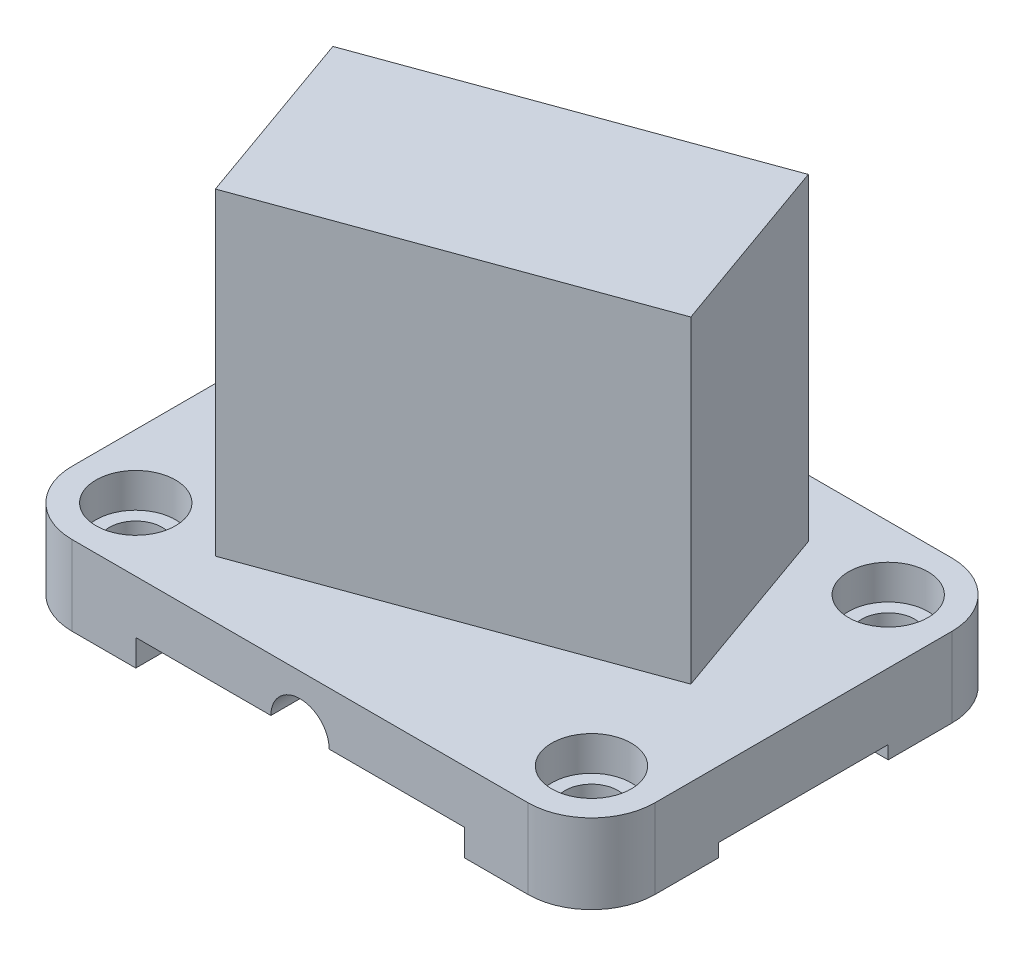
ISO-10303-21;
HEADER;
FILE_DESCRIPTION(('STEP AP214'),'2;1');
FILE_NAME('part.step','',(''),(''),'','','');
FILE_SCHEMA(('AUTOMOTIVE_DESIGN { 1 0 10303 214 1 1 1 1 }'));
ENDSEC;
DATA;
#1=APPLICATION_CONTEXT('core data for automotive mechanical design processes');
#2=APPLICATION_PROTOCOL_DEFINITION('international standard','automotive_design',2000,#1);
#3=PRODUCT_CONTEXT('',#1,'mechanical');
#4=PRODUCT('Part','Part','',(#3));
#5=PRODUCT_RELATED_PRODUCT_CATEGORY('part','',(#4));
#6=PRODUCT_DEFINITION_FORMATION('','',#4);
#7=PRODUCT_DEFINITION_CONTEXT('part definition',#1,'design');
#8=PRODUCT_DEFINITION('design','',#6,#7);
#9=PRODUCT_DEFINITION_SHAPE('','',#8);
#10=(LENGTH_UNIT() NAMED_UNIT(*) SI_UNIT(.MILLI.,.METRE.));
#11=(NAMED_UNIT(*) PLANE_ANGLE_UNIT() SI_UNIT($,.RADIAN.));
#12=(NAMED_UNIT(*) SI_UNIT($,.STERADIAN.) SOLID_ANGLE_UNIT());
#13=UNCERTAINTY_MEASURE_WITH_UNIT(LENGTH_MEASURE(1.E-05),#10,'distance_accuracy_value','');
#14=(GEOMETRIC_REPRESENTATION_CONTEXT(3) GLOBAL_UNCERTAINTY_ASSIGNED_CONTEXT((#13)) GLOBAL_UNIT_ASSIGNED_CONTEXT((#10,
#11,#12)) REPRESENTATION_CONTEXT('',''));
#15=CARTESIAN_POINT('',(0.,0.,0.));
#16=DIRECTION('',(0.,0.,1.));
#17=DIRECTION('',(1.,0.,0.));
#18=AXIS2_PLACEMENT_3D('',#15,#16,#17);
#19=CARTESIAN_POINT('',(-54.61,19.05,-35.56));
#20=DIRECTION('',(0.,1.,0.));
#21=DIRECTION('',(0.,0.,1.));
#22=AXIS2_PLACEMENT_3D('',#19,#20,#21);
#23=PLANE('',#22);
#24=CARTESIAN_POINT('',(-54.61,19.05,-35.56));
#25=DIRECTION('',(0.,1.,0.));
#26=DIRECTION('',(0.,0.,1.));
#27=AXIS2_PLACEMENT_3D('',#24,#25,#26);
#28=CIRCLE('',#27,9.525);
#29=CARTESIAN_POINT('',(-54.61,19.05,-26.035));
#30=VERTEX_POINT('',#29);
#31=EDGE_CURVE('E314',#30,#30,#28,.T.);
#32=ORIENTED_EDGE('',*,*,#31,.F.);
#33=EDGE_LOOP('',(#32));
#34=FACE_BOUND('',#33,.T.);
#35=CARTESIAN_POINT('',(54.61,19.05,-35.56));
#36=DIRECTION('',(0.,1.,0.));
#37=DIRECTION('',(0.,0.,1.));
#38=AXIS2_PLACEMENT_3D('',#35,#36,#37);
#39=CIRCLE('',#38,9.525);
#40=CARTESIAN_POINT('',(54.61,19.05,-26.035));
#41=VERTEX_POINT('',#40);
#42=EDGE_CURVE('E338',#41,#41,#39,.T.);
#43=ORIENTED_EDGE('',*,*,#42,.F.);
#44=EDGE_LOOP('',(#43));
#45=FACE_BOUND('',#44,.T.);
#46=CARTESIAN_POINT('',(-54.61,19.05,35.56));
#47=DIRECTION('',(0.,1.,0.));
#48=DIRECTION('',(0.,0.,1.));
#49=AXIS2_PLACEMENT_3D('',#46,#47,#48);
#50=CIRCLE('',#49,9.525);
#51=CARTESIAN_POINT('',(-54.61,19.05,45.085));
#52=VERTEX_POINT('',#51);
#53=EDGE_CURVE('E350',#52,#52,#50,.T.);
#54=ORIENTED_EDGE('',*,*,#53,.F.);
#55=EDGE_LOOP('',(#54));
#56=FACE_BOUND('',#55,.T.);
#57=CARTESIAN_POINT('',(54.61,19.05,35.56));
#58=DIRECTION('',(0.,1.,0.));
#59=DIRECTION('',(0.,0.,1.));
#60=AXIS2_PLACEMENT_3D('',#57,#58,#59);
#61=CIRCLE('',#60,9.525);
#62=CARTESIAN_POINT('',(54.61,19.05,45.085));
#63=VERTEX_POINT('',#62);
#64=EDGE_CURVE('E362',#63,#63,#61,.T.);
#65=ORIENTED_EDGE('',*,*,#64,.F.);
#66=EDGE_LOOP('',(#65));
#67=FACE_BOUND('',#66,.T.);
#68=CARTESIAN_POINT('',(-54.61,19.05,-35.56));
#69=DIRECTION('',(0.,1.,0.));
#70=DIRECTION('',(0.,0.,1.));
#71=AXIS2_PLACEMENT_3D('',#68,#69,#70);
#72=CIRCLE('',#71,15.24);
#73=CARTESIAN_POINT('',(-54.6099999999999,19.05,-50.8));
#74=VERTEX_POINT('',#73);
#75=CARTESIAN_POINT('',(-69.85,19.05,-35.5599999999999));
#76=VERTEX_POINT('',#75);
#77=EDGE_CURVE('E375',#74,#76,#72,.T.);
#78=ORIENTED_EDGE('',*,*,#77,.T.);
#79=DIRECTION('',(0.,0.,1.));
#80=VECTOR('',#79,1.);
#81=CARTESIAN_POINT('',(-69.85,19.05,-35.5599999999999));
#82=LINE('',#81,#80);
#83=CARTESIAN_POINT('',(-69.85,19.05,35.5599999999999));
#84=VERTEX_POINT('',#83);
#85=EDGE_CURVE('E378',#76,#84,#82,.T.);
#86=ORIENTED_EDGE('',*,*,#85,.T.);
#87=CARTESIAN_POINT('',(-54.61,19.05,35.56));
#88=DIRECTION('',(0.,1.,0.));
#89=DIRECTION('',(0.,0.,1.));
#90=AXIS2_PLACEMENT_3D('',#87,#88,#89);
#91=CIRCLE('',#90,15.24);
#92=CARTESIAN_POINT('',(-54.6099999999999,19.05,50.8));
#93=VERTEX_POINT('',#92);
#94=EDGE_CURVE('E381',#84,#93,#91,.T.);
#95=ORIENTED_EDGE('',*,*,#94,.T.);
#96=DIRECTION('',(1.,0.,0.));
#97=VECTOR('',#96,1.);
#98=CARTESIAN_POINT('',(-54.6099999999999,19.05,50.8));
#99=LINE('',#98,#97);
#100=CARTESIAN_POINT('',(54.6099999999999,19.05,50.8));
#101=VERTEX_POINT('',#100);
#102=EDGE_CURVE('E383',#93,#101,#99,.T.);
#103=ORIENTED_EDGE('',*,*,#102,.T.);
#104=CARTESIAN_POINT('',(54.61,19.05,35.56));
#105=DIRECTION('',(0.,1.,0.));
#106=DIRECTION('',(0.,0.,1.));
#107=AXIS2_PLACEMENT_3D('',#104,#105,#106);
#108=CIRCLE('',#107,15.24);
#109=CARTESIAN_POINT('',(69.85,19.05,35.5599999999999));
#110=VERTEX_POINT('',#109);
#111=EDGE_CURVE('E385',#101,#110,#108,.T.);
#112=ORIENTED_EDGE('',*,*,#111,.T.);
#113=DIRECTION('',(0.,0.,-1.));
#114=VECTOR('',#113,1.);
#115=CARTESIAN_POINT('',(69.85,19.05,-35.5599999999999));
#116=LINE('',#115,#114);
#117=CARTESIAN_POINT('',(69.85,19.05,-35.5599999999999));
#118=VERTEX_POINT('',#117);
#119=EDGE_CURVE('E387',#110,#118,#116,.T.);
#120=ORIENTED_EDGE('',*,*,#119,.T.);
#121=CARTESIAN_POINT('',(54.61,19.05,-35.56));
#122=DIRECTION('',(0.,1.,0.));
#123=DIRECTION('',(0.,0.,-1.));
#124=AXIS2_PLACEMENT_3D('',#121,#122,#123);
#125=CIRCLE('',#124,15.24);
#126=CARTESIAN_POINT('',(54.6099999999999,19.05,-50.8));
#127=VERTEX_POINT('',#126);
#128=EDGE_CURVE('E389',#118,#127,#125,.T.);
#129=ORIENTED_EDGE('',*,*,#128,.T.);
#130=DIRECTION('',(-1.,0.,0.));
#131=VECTOR('',#130,1.);
#132=CARTESIAN_POINT('',(-54.6099999999999,19.05,-50.8));
#133=LINE('',#132,#131);
#134=EDGE_CURVE('E391',#127,#74,#133,.T.);
#135=ORIENTED_EDGE('',*,*,#134,.T.);
#136=EDGE_LOOP('',(#78,#86,#95,#103,#112,#120,#129,#135));
#137=FACE_BOUND('',#136,.T.);
#138=DIRECTION('',(0.334836069725655,0.,0.942276395974491));
#139=VECTOR('',#138,1.);
#140=CARTESIAN_POINT('',(-49.53,19.05,-6.60400000000001));
#141=LINE('',#140,#139);
#142=CARTESIAN_POINT('',(-49.53,19.05,-6.60400000000001));
#143=VERTEX_POINT('',#142);
#144=CARTESIAN_POINT('',(-34.0086739878672,19.05,37.0752223353975));
#145=VERTEX_POINT('',#144);
#146=EDGE_CURVE('E850',#143,#145,#141,.T.);
#147=ORIENTED_EDGE('',*,*,#146,.F.);
#148=DIRECTION('',(-0.939692620785908,0.,0.34202014332567));
#149=VECTOR('',#148,1.);
#150=CARTESIAN_POINT('',(34.0086739878672,19.05,-37.009590741652));
#151=LINE('',#150,#149);
#152=CARTESIAN_POINT('',(34.0086739878672,19.05,-37.009590741652));
#153=VERTEX_POINT('',#152);
#154=EDGE_CURVE('E235',#153,#143,#151,.T.);
#155=ORIENTED_EDGE('',*,*,#154,.F.);
#156=DIRECTION('',(-0.334836069725655,0.,-0.942276395974491));
#157=VECTOR('',#156,1.);
#158=CARTESIAN_POINT('',(49.53,19.05,6.66963159374552));
#159=LINE('',#158,#157);
#160=CARTESIAN_POINT('',(49.53,19.05,6.66963159374552));
#161=VERTEX_POINT('',#160);
#162=EDGE_CURVE('E231',#161,#153,#159,.T.);
#163=ORIENTED_EDGE('',*,*,#162,.F.);
#164=DIRECTION('',(0.939692620785908,0.,-0.342020143325669));
#165=VECTOR('',#164,1.);
#166=CARTESIAN_POINT('',(-34.0086739878672,19.05,37.0752223353975));
#167=LINE('',#166,#165);
#168=EDGE_CURVE('E847',#145,#161,#167,.T.);
#169=ORIENTED_EDGE('',*,*,#168,.F.);
#170=EDGE_LOOP('',(#147,#155,#163,#169));
#171=FACE_BOUND('',#170,.T.);
#172=ADVANCED_FACE('F39',(#34,#45,#56,#67,#137,#171),#23,.T.);
#173=CARTESIAN_POINT('',(-54.61,0.,-35.56));
#174=DIRECTION('',(0.,1.,0.));
#175=DIRECTION('',(0.,0.,1.));
#176=AXIS2_PLACEMENT_3D('',#173,#174,#175);
#177=PLANE('',#176);
#178=CARTESIAN_POINT('',(-54.61,0.,-35.56));
#179=DIRECTION('',(0.,1.,0.));
#180=DIRECTION('',(0.,0.,1.));
#181=AXIS2_PLACEMENT_3D('',#178,#179,#180);
#182=CIRCLE('',#181,6.35);
#183=CARTESIAN_POINT('',(-54.61,0.,-29.21));
#184=VERTEX_POINT('',#183);
#185=EDGE_CURVE('E335',#184,#184,#182,.T.);
#186=ORIENTED_EDGE('',*,*,#185,.T.);
#187=EDGE_LOOP('',(#186));
#188=FACE_BOUND('',#187,.T.);
#189=DIRECTION('',(0.,0.,1.));
#190=VECTOR('',#189,1.);
#191=CARTESIAN_POINT('',(-39.37,0.,-50.8));
#192=LINE('',#191,#190);
#193=CARTESIAN_POINT('',(-39.37,0.,-50.8));
#194=VERTEX_POINT('',#193);
#195=CARTESIAN_POINT('',(-39.37,0.,-20.32));
#196=VERTEX_POINT('',#195);
#197=EDGE_CURVE('E311',#194,#196,#192,.T.);
#198=ORIENTED_EDGE('',*,*,#197,.T.);
#199=DIRECTION('',(-1.,0.,0.));
#200=VECTOR('',#199,1.);
#201=CARTESIAN_POINT('',(69.85,0.,-20.32));
#202=LINE('',#201,#200);
#203=CARTESIAN_POINT('',(-69.85,0.,-20.32));
#204=VERTEX_POINT('',#203);
#205=EDGE_CURVE('E262',#196,#204,#202,.T.);
#206=ORIENTED_EDGE('',*,*,#205,.T.);
#207=DIRECTION('',(0.,0.,1.));
#208=VECTOR('',#207,1.);
#209=CARTESIAN_POINT('',(-69.85,0.,-35.5599999999999));
#210=LINE('',#209,#208);
#211=CARTESIAN_POINT('',(-69.85,0.,-35.5599999999999));
#212=VERTEX_POINT('',#211);
#213=EDGE_CURVE('E397',#212,#204,#210,.T.);
#214=ORIENTED_EDGE('',*,*,#213,.F.);
#215=CARTESIAN_POINT('',(-54.61,0.,-35.56));
#216=DIRECTION('',(0.,1.,0.));
#217=DIRECTION('',(0.,0.,1.));
#218=AXIS2_PLACEMENT_3D('',#215,#216,#217);
#219=CIRCLE('',#218,15.24);
#220=CARTESIAN_POINT('',(-54.6099999999999,0.,-50.8));
#221=VERTEX_POINT('',#220);
#222=EDGE_CURVE('E374',#221,#212,#219,.T.);
#223=ORIENTED_EDGE('',*,*,#222,.F.);
#224=DIRECTION('',(-1.,0.,0.));
#225=VECTOR('',#224,1.);
#226=CARTESIAN_POINT('',(-54.6099999999999,0.,-50.8));
#227=LINE('',#226,#225);
#228=EDGE_CURVE('E414',#194,#221,#227,.T.);
#229=ORIENTED_EDGE('',*,*,#228,.F.);
#230=EDGE_LOOP('',(#198,#206,#214,#223,#229));
#231=FACE_BOUND('',#230,.T.);
#232=ADVANCED_FACE('F518',(#188,#231),#177,.F.);
#233=CARTESIAN_POINT('',(54.61,0.,-35.56));
#234=DIRECTION('',(0.,1.,0.));
#235=DIRECTION('',(0.,0.,1.));
#236=AXIS2_PLACEMENT_3D('',#233,#234,#235);
#237=CIRCLE('',#236,6.35);
#238=CARTESIAN_POINT('',(54.61,0.,-29.21));
#239=VERTEX_POINT('',#238);
#240=EDGE_CURVE('E347',#239,#239,#237,.T.);
#241=ORIENTED_EDGE('',*,*,#240,.T.);
#242=EDGE_LOOP('',(#241));
#243=FACE_BOUND('',#242,.T.);
#244=DIRECTION('',(0.,0.,-1.));
#245=VECTOR('',#244,1.);
#246=CARTESIAN_POINT('',(69.85,0.,-35.5599999999999));
#247=LINE('',#246,#245);
#248=CARTESIAN_POINT('',(69.85,0.,-20.32));
#249=VERTEX_POINT('',#248);
#250=CARTESIAN_POINT('',(69.85,0.,-35.5599999999999));
#251=VERTEX_POINT('',#250);
#252=EDGE_CURVE('E408',#249,#251,#247,.T.);
#253=ORIENTED_EDGE('',*,*,#252,.F.);
#254=CARTESIAN_POINT('',(39.37,0.,-20.32));
#255=VERTEX_POINT('',#254);
#256=EDGE_CURVE('E258',#249,#255,#202,.T.);
#257=ORIENTED_EDGE('',*,*,#256,.T.);
#258=DIRECTION('',(0.,0.,1.));
#259=VECTOR('',#258,1.);
#260=CARTESIAN_POINT('',(39.37,0.,-50.8));
#261=LINE('',#260,#259);
#262=CARTESIAN_POINT('',(39.37,0.,-50.8));
#263=VERTEX_POINT('',#262);
#264=EDGE_CURVE('E324',#263,#255,#261,.T.);
#265=ORIENTED_EDGE('',*,*,#264,.F.);
#266=CARTESIAN_POINT('',(54.6099999999999,0.,-50.8));
#267=VERTEX_POINT('',#266);
#268=EDGE_CURVE('E379',#267,#263,#227,.T.);
#269=ORIENTED_EDGE('',*,*,#268,.F.);
#270=CARTESIAN_POINT('',(54.61,0.,-35.56));
#271=DIRECTION('',(0.,1.,0.));
#272=DIRECTION('',(0.,0.,-1.));
#273=AXIS2_PLACEMENT_3D('',#270,#271,#272);
#274=CIRCLE('',#273,15.24);
#275=EDGE_CURVE('E412',#251,#267,#274,.T.);
#276=ORIENTED_EDGE('',*,*,#275,.F.);
#277=EDGE_LOOP('',(#253,#257,#265,#269,#276));
#278=FACE_BOUND('',#277,.T.);
#279=ADVANCED_FACE('F478',(#243,#278),#177,.F.);
#280=CARTESIAN_POINT('',(-54.61,0.,35.56));
#281=DIRECTION('',(0.,1.,0.));
#282=DIRECTION('',(0.,0.,1.));
#283=AXIS2_PLACEMENT_3D('',#280,#281,#282);
#284=CIRCLE('',#283,6.35);
#285=CARTESIAN_POINT('',(-54.61,0.,41.91));
#286=VERTEX_POINT('',#285);
#287=EDGE_CURVE('E359',#286,#286,#284,.T.);
#288=ORIENTED_EDGE('',*,*,#287,.T.);
#289=EDGE_LOOP('',(#288));
#290=FACE_BOUND('',#289,.T.);
#291=CARTESIAN_POINT('',(-69.85,0.,20.32));
#292=VERTEX_POINT('',#291);
#293=CARTESIAN_POINT('',(-69.85,0.,35.5599999999999));
#294=VERTEX_POINT('',#293);
#295=EDGE_CURVE('E396',#292,#294,#210,.T.);
#296=ORIENTED_EDGE('',*,*,#295,.F.);
#297=DIRECTION('',(-1.,0.,0.));
#298=VECTOR('',#297,1.);
#299=CARTESIAN_POINT('',(69.85,0.,20.32));
#300=LINE('',#299,#298);
#301=CARTESIAN_POINT('',(-39.37,0.,20.32));
#302=VERTEX_POINT('',#301);
#303=EDGE_CURVE('E253',#302,#292,#300,.T.);
#304=ORIENTED_EDGE('',*,*,#303,.F.);
#305=CARTESIAN_POINT('',(-39.37,0.,50.8));
#306=VERTEX_POINT('',#305);
#307=EDGE_CURVE('E315',#302,#306,#192,.T.);
#308=ORIENTED_EDGE('',*,*,#307,.T.);
#309=DIRECTION('',(1.,0.,0.));
#310=VECTOR('',#309,1.);
#311=CARTESIAN_POINT('',(-54.6099999999999,0.,50.8));
#312=LINE('',#311,#310);
#313=CARTESIAN_POINT('',(-54.6099999999999,0.,50.8));
#314=VERTEX_POINT('',#313);
#315=EDGE_CURVE('E403',#314,#306,#312,.T.);
#316=ORIENTED_EDGE('',*,*,#315,.F.);
#317=CARTESIAN_POINT('',(-54.61,0.,35.56));
#318=DIRECTION('',(0.,1.,0.));
#319=DIRECTION('',(0.,0.,1.));
#320=AXIS2_PLACEMENT_3D('',#317,#318,#319);
#321=CIRCLE('',#320,15.24);
#322=EDGE_CURVE('E400',#294,#314,#321,.T.);
#323=ORIENTED_EDGE('',*,*,#322,.F.);
#324=EDGE_LOOP('',(#296,#304,#308,#316,#323));
#325=FACE_BOUND('',#324,.T.);
#326=ADVANCED_FACE('F504',(#290,#325),#177,.F.);
#327=CARTESIAN_POINT('',(-54.61,19.05,-35.56));
#328=DIRECTION('',(0.,-1.,0.));
#329=DIRECTION('',(0.,0.,-1.));
#330=AXIS2_PLACEMENT_3D('',#327,#328,#329);
#331=CYLINDRICAL_SURFACE('',#330,15.24);
#332=ORIENTED_EDGE('',*,*,#222,.T.);
#333=DIRECTION('',(0.,-1.,0.));
#334=VECTOR('',#333,1.);
#335=CARTESIAN_POINT('',(-69.85,19.05,-35.5599999999999));
#336=LINE('',#335,#334);
#337=EDGE_CURVE('E437',#76,#212,#336,.T.);
#338=ORIENTED_EDGE('',*,*,#337,.F.);
#339=ORIENTED_EDGE('',*,*,#77,.F.);
#340=DIRECTION('',(0.,-1.,0.));
#341=VECTOR('',#340,1.);
#342=CARTESIAN_POINT('',(-54.6099999999999,19.05,-50.8));
#343=LINE('',#342,#341);
#344=EDGE_CURVE('E393',#74,#221,#343,.T.);
#345=ORIENTED_EDGE('',*,*,#344,.T.);
#346=EDGE_LOOP('',(#332,#338,#339,#345));
#347=FACE_BOUND('',#346,.T.);
#348=ADVANCED_FACE('F41',(#347),#331,.T.);
#349=CARTESIAN_POINT('',(-69.85,19.05,-35.5599999999999));
#350=DIRECTION('',(1.,0.,0.));
#351=DIRECTION('',(0.,0.,-1.));
#352=AXIS2_PLACEMENT_3D('',#349,#350,#351);
#353=PLANE('',#352);
#354=ORIENTED_EDGE('',*,*,#213,.T.);
#355=DIRECTION('',(0.,-1.,0.));
#356=VECTOR('',#355,1.);
#357=CARTESIAN_POINT('',(-69.85,0.,-20.32));
#358=LINE('',#357,#356);
#359=CARTESIAN_POINT('',(-69.85,3.17499999999999,-20.32));
#360=VERTEX_POINT('',#359);
#361=EDGE_CURVE('E248',#360,#204,#358,.T.);
#362=ORIENTED_EDGE('',*,*,#361,.F.);
#363=DIRECTION('',(0.,0.,-1.));
#364=VECTOR('',#363,1.);
#365=CARTESIAN_POINT('',(-69.85,3.17499999999999,-20.32));
#366=LINE('',#365,#364);
#367=CARTESIAN_POINT('',(-69.85,3.17499999999999,20.32));
#368=VERTEX_POINT('',#367);
#369=EDGE_CURVE('E239',#368,#360,#366,.T.);
#370=ORIENTED_EDGE('',*,*,#369,.F.);
#371=DIRECTION('',(0.,1.,0.));
#372=VECTOR('',#371,1.);
#373=CARTESIAN_POINT('',(-69.85,3.17499999999999,20.32));
#374=LINE('',#373,#372);
#375=EDGE_CURVE('E237',#292,#368,#374,.T.);
#376=ORIENTED_EDGE('',*,*,#375,.F.);
#377=ORIENTED_EDGE('',*,*,#295,.T.);
#378=DIRECTION('',(0.,-1.,0.));
#379=VECTOR('',#378,1.);
#380=CARTESIAN_POINT('',(-69.85,19.05,35.5599999999999));
#381=LINE('',#380,#379);
#382=EDGE_CURVE('E434',#84,#294,#381,.T.);
#383=ORIENTED_EDGE('',*,*,#382,.F.);
#384=ORIENTED_EDGE('',*,*,#85,.F.);
#385=ORIENTED_EDGE('',*,*,#337,.T.);
#386=EDGE_LOOP('',(#354,#362,#370,#376,#377,#383,#384,#385));
#387=FACE_BOUND('',#386,.T.);
#388=ADVANCED_FACE('F525',(#387),#353,.F.);
#389=CARTESIAN_POINT('',(-54.61,19.05,35.56));
#390=DIRECTION('',(0.,-1.,0.));
#391=DIRECTION('',(0.,0.,-1.));
#392=AXIS2_PLACEMENT_3D('',#389,#390,#391);
#393=CYLINDRICAL_SURFACE('',#392,15.24);
#394=ORIENTED_EDGE('',*,*,#322,.T.);
#395=DIRECTION('',(0.,-1.,0.));
#396=VECTOR('',#395,1.);
#397=CARTESIAN_POINT('',(-54.6099999999999,19.05,50.8));
#398=LINE('',#397,#396);
#399=EDGE_CURVE('E431',#93,#314,#398,.T.);
#400=ORIENTED_EDGE('',*,*,#399,.F.);
#401=ORIENTED_EDGE('',*,*,#94,.F.);
#402=ORIENTED_EDGE('',*,*,#382,.T.);
#403=EDGE_LOOP('',(#394,#400,#401,#402));
#404=FACE_BOUND('',#403,.T.);
#405=ADVANCED_FACE('F527',(#404),#393,.T.);
#406=CARTESIAN_POINT('',(-54.6099999999999,19.05,50.8));
#407=DIRECTION('',(0.,0.,-1.));
#408=DIRECTION('',(-1.,0.,0.));
#409=AXIS2_PLACEMENT_3D('',#406,#407,#408);
#410=PLANE('',#409);
#411=ORIENTED_EDGE('',*,*,#315,.T.);
#412=DIRECTION('',(0.,-1.,0.));
#413=VECTOR('',#412,1.);
#414=CARTESIAN_POINT('',(-39.37,0.,50.8));
#415=LINE('',#414,#413);
#416=CARTESIAN_POINT('',(-39.37,6.34999999999999,50.8));
#417=VERTEX_POINT('',#416);
#418=EDGE_CURVE('E285',#417,#306,#415,.T.);
#419=ORIENTED_EDGE('',*,*,#418,.F.);
#420=DIRECTION('',(-1.,0.,0.));
#421=VECTOR('',#420,1.);
#422=CARTESIAN_POINT('',(-39.37,6.34999999999999,50.8));
#423=LINE('',#422,#421);
#424=CARTESIAN_POINT('',(-6.985,6.34999999999999,50.8));
#425=VERTEX_POINT('',#424);
#426=EDGE_CURVE('E306',#425,#417,#423,.T.);
#427=ORIENTED_EDGE('',*,*,#426,.F.);
#428=CARTESIAN_POINT('',(0.,6.34999999999999,50.8));
#429=DIRECTION('',(0.,0.,1.));
#430=DIRECTION('',(1.,0.,0.));
#431=AXIS2_PLACEMENT_3D('',#428,#429,#430);
#432=CIRCLE('',#431,6.985);
#433=CARTESIAN_POINT('',(6.985,6.34999999999999,50.8));
#434=VERTEX_POINT('',#433);
#435=EDGE_CURVE('E303',#434,#425,#432,.T.);
#436=ORIENTED_EDGE('',*,*,#435,.F.);
#437=DIRECTION('',(-1.,0.,0.));
#438=VECTOR('',#437,1.);
#439=CARTESIAN_POINT('',(6.985,6.34999999999999,50.8));
#440=LINE('',#439,#438);
#441=CARTESIAN_POINT('',(39.37,6.34999999999999,50.8));
#442=VERTEX_POINT('',#441);
#443=EDGE_CURVE('E300',#442,#434,#440,.T.);
#444=ORIENTED_EDGE('',*,*,#443,.F.);
#445=DIRECTION('',(0.,1.,0.));
#446=VECTOR('',#445,1.);
#447=CARTESIAN_POINT('',(39.37,6.34999999999999,50.8));
#448=LINE('',#447,#446);
#449=CARTESIAN_POINT('',(39.37,0.,50.8));
#450=VERTEX_POINT('',#449);
#451=EDGE_CURVE('E280',#450,#442,#448,.T.);
#452=ORIENTED_EDGE('',*,*,#451,.F.);
#453=CARTESIAN_POINT('',(54.6099999999999,0.,50.8));
#454=VERTEX_POINT('',#453);
#455=EDGE_CURVE('E402',#450,#454,#312,.T.);
#456=ORIENTED_EDGE('',*,*,#455,.T.);
#457=DIRECTION('',(0.,-1.,0.));
#458=VECTOR('',#457,1.);
#459=CARTESIAN_POINT('',(54.6099999999999,19.05,50.8));
#460=LINE('',#459,#458);
#461=EDGE_CURVE('E428',#101,#454,#460,.T.);
#462=ORIENTED_EDGE('',*,*,#461,.F.);
#463=ORIENTED_EDGE('',*,*,#102,.F.);
#464=ORIENTED_EDGE('',*,*,#399,.T.);
#465=EDGE_LOOP('',(#411,#419,#427,#436,#444,#452,#456,#462,#463,#464));
#466=FACE_BOUND('',#465,.T.);
#467=ADVANCED_FACE('F466',(#466),#410,.F.);
#468=CARTESIAN_POINT('',(54.61,19.05,35.56));
#469=DIRECTION('',(0.,-1.,0.));
#470=DIRECTION('',(0.,0.,-1.));
#471=AXIS2_PLACEMENT_3D('',#468,#469,#470);
#472=CYLINDRICAL_SURFACE('',#471,15.24);
#473=CARTESIAN_POINT('',(54.61,0.,35.56));
#474=DIRECTION('',(0.,1.,0.));
#475=DIRECTION('',(0.,0.,1.));
#476=AXIS2_PLACEMENT_3D('',#473,#474,#475);
#477=CIRCLE('',#476,15.24);
#478=CARTESIAN_POINT('',(69.85,0.,35.5599999999999));
#479=VERTEX_POINT('',#478);
#480=EDGE_CURVE('E406',#454,#479,#477,.T.);
#481=ORIENTED_EDGE('',*,*,#480,.T.);
#482=DIRECTION('',(0.,-1.,0.));
#483=VECTOR('',#482,1.);
#484=CARTESIAN_POINT('',(69.85,19.05,35.5599999999999));
#485=LINE('',#484,#483);
#486=EDGE_CURVE('E425',#110,#479,#485,.T.);
#487=ORIENTED_EDGE('',*,*,#486,.F.);
#488=ORIENTED_EDGE('',*,*,#111,.F.);
#489=ORIENTED_EDGE('',*,*,#461,.T.);
#490=EDGE_LOOP('',(#481,#487,#488,#489));
#491=FACE_BOUND('',#490,.T.);
#492=ADVANCED_FACE('F495',(#491),#472,.T.);
#493=CARTESIAN_POINT('',(69.85,19.05,-35.5599999999999));
#494=DIRECTION('',(-1.,0.,0.));
#495=DIRECTION('',(0.,0.,1.));
#496=AXIS2_PLACEMENT_3D('',#493,#494,#495);
#497=PLANE('',#496);
#498=DIRECTION('',(0.,0.,-1.));
#499=VECTOR('',#498,1.);
#500=CARTESIAN_POINT('',(69.85,3.17499999999999,-20.32));
#501=LINE('',#500,#499);
#502=CARTESIAN_POINT('',(69.85,3.17499999999999,20.32));
#503=VERTEX_POINT('',#502);
#504=CARTESIAN_POINT('',(69.85,3.17499999999999,-20.32));
#505=VERTEX_POINT('',#504);
#506=EDGE_CURVE('E247',#503,#505,#501,.T.);
#507=ORIENTED_EDGE('',*,*,#506,.T.);
#508=DIRECTION('',(0.,-1.,0.));
#509=VECTOR('',#508,1.);
#510=CARTESIAN_POINT('',(69.85,0.,-20.32));
#511=LINE('',#510,#509);
#512=EDGE_CURVE('E251',#505,#249,#511,.T.);
#513=ORIENTED_EDGE('',*,*,#512,.T.);
#514=ORIENTED_EDGE('',*,*,#252,.T.);
#515=DIRECTION('',(0.,-1.,0.));
#516=VECTOR('',#515,1.);
#517=CARTESIAN_POINT('',(69.85,19.05,-35.5599999999999));
#518=LINE('',#517,#516);
#519=EDGE_CURVE('E422',#118,#251,#518,.T.);
#520=ORIENTED_EDGE('',*,*,#519,.F.);
#521=ORIENTED_EDGE('',*,*,#119,.F.);
#522=ORIENTED_EDGE('',*,*,#486,.T.);
#523=CARTESIAN_POINT('',(69.85,0.,20.32));
#524=VERTEX_POINT('',#523);
#525=EDGE_CURVE('E409',#479,#524,#247,.T.);
#526=ORIENTED_EDGE('',*,*,#525,.T.);
#527=DIRECTION('',(0.,1.,0.));
#528=VECTOR('',#527,1.);
#529=CARTESIAN_POINT('',(69.85,3.17499999999999,20.32));
#530=LINE('',#529,#528);
#531=EDGE_CURVE('E244',#524,#503,#530,.T.);
#532=ORIENTED_EDGE('',*,*,#531,.T.);
#533=EDGE_LOOP('',(#507,#513,#514,#520,#521,#522,#526,#532));
#534=FACE_BOUND('',#533,.T.);
#535=ADVANCED_FACE('F454',(#534),#497,.F.);
#536=CARTESIAN_POINT('',(54.61,19.05,-35.56));
#537=DIRECTION('',(0.,-1.,0.));
#538=DIRECTION('',(0.,0.,-1.));
#539=AXIS2_PLACEMENT_3D('',#536,#537,#538);
#540=CYLINDRICAL_SURFACE('',#539,15.24);
#541=ORIENTED_EDGE('',*,*,#275,.T.);
#542=DIRECTION('',(0.,-1.,0.));
#543=VECTOR('',#542,1.);
#544=CARTESIAN_POINT('',(54.6099999999999,19.05,-50.8));
#545=LINE('',#544,#543);
#546=EDGE_CURVE('E419',#127,#267,#545,.T.);
#547=ORIENTED_EDGE('',*,*,#546,.F.);
#548=ORIENTED_EDGE('',*,*,#128,.F.);
#549=ORIENTED_EDGE('',*,*,#519,.T.);
#550=EDGE_LOOP('',(#541,#547,#548,#549));
#551=FACE_BOUND('',#550,.T.);
#552=ADVANCED_FACE('F486',(#551),#540,.T.);
#553=CARTESIAN_POINT('',(-54.6099999999999,19.05,-50.8));
#554=DIRECTION('',(0.,0.,1.));
#555=DIRECTION('',(1.,0.,0.));
#556=AXIS2_PLACEMENT_3D('',#553,#554,#555);
#557=PLANE('',#556);
#558=DIRECTION('',(-1.,0.,0.));
#559=VECTOR('',#558,1.);
#560=CARTESIAN_POINT('',(-39.37,6.34999999999999,-50.8));
#561=LINE('',#560,#559);
#562=CARTESIAN_POINT('',(-6.985,6.34999999999999,-50.8));
#563=VERTEX_POINT('',#562);
#564=CARTESIAN_POINT('',(-39.37,6.34999999999999,-50.8));
#565=VERTEX_POINT('',#564);
#566=EDGE_CURVE('E291',#563,#565,#561,.T.);
#567=ORIENTED_EDGE('',*,*,#566,.T.);
#568=DIRECTION('',(0.,-1.,0.));
#569=VECTOR('',#568,1.);
#570=CARTESIAN_POINT('',(-39.37,0.,-50.8));
#571=LINE('',#570,#569);
#572=EDGE_CURVE('E294',#565,#194,#571,.T.);
#573=ORIENTED_EDGE('',*,*,#572,.T.);
#574=ORIENTED_EDGE('',*,*,#228,.T.);
#575=ORIENTED_EDGE('',*,*,#344,.F.);
#576=ORIENTED_EDGE('',*,*,#134,.F.);
#577=ORIENTED_EDGE('',*,*,#546,.T.);
#578=ORIENTED_EDGE('',*,*,#268,.T.);
#579=DIRECTION('',(0.,1.,0.));
#580=VECTOR('',#579,1.);
#581=CARTESIAN_POINT('',(39.37,6.34999999999999,-50.8));
#582=LINE('',#581,#580);
#583=CARTESIAN_POINT('',(39.37,6.34999999999999,-50.8));
#584=VERTEX_POINT('',#583);
#585=EDGE_CURVE('E281',#263,#584,#582,.T.);
#586=ORIENTED_EDGE('',*,*,#585,.T.);
#587=DIRECTION('',(-1.,0.,0.));
#588=VECTOR('',#587,1.);
#589=CARTESIAN_POINT('',(6.985,6.34999999999999,-50.8));
#590=LINE('',#589,#588);
#591=CARTESIAN_POINT('',(6.985,6.34999999999999,-50.8));
#592=VERTEX_POINT('',#591);
#593=EDGE_CURVE('E284',#584,#592,#590,.T.);
#594=ORIENTED_EDGE('',*,*,#593,.T.);
#595=CARTESIAN_POINT('',(0.,6.34999999999999,-50.8));
#596=DIRECTION('',(0.,0.,1.));
#597=DIRECTION('',(1.,0.,0.));
#598=AXIS2_PLACEMENT_3D('',#595,#596,#597);
#599=CIRCLE('',#598,6.985);
#600=EDGE_CURVE('E288',#592,#563,#599,.T.);
#601=ORIENTED_EDGE('',*,*,#600,.T.);
#602=EDGE_LOOP('',(#567,#573,#574,#575,#576,#577,#578,#586,#594,#601));
#603=FACE_BOUND('',#602,.T.);
#604=ADVANCED_FACE('F480',(#603),#557,.F.);
#605=CARTESIAN_POINT('',(54.61,0.,35.56));
#606=DIRECTION('',(0.,1.,0.));
#607=DIRECTION('',(0.,0.,1.));
#608=AXIS2_PLACEMENT_3D('',#605,#606,#607);
#609=CIRCLE('',#608,6.35);
#610=CARTESIAN_POINT('',(54.61,0.,41.91));
#611=VERTEX_POINT('',#610);
#612=EDGE_CURVE('E371',#611,#611,#609,.T.);
#613=ORIENTED_EDGE('',*,*,#612,.T.);
#614=EDGE_LOOP('',(#613));
#615=FACE_BOUND('',#614,.T.);
#616=CARTESIAN_POINT('',(39.37,0.,20.32));
#617=VERTEX_POINT('',#616);
#618=EDGE_CURVE('E297',#617,#450,#261,.T.);
#619=ORIENTED_EDGE('',*,*,#618,.F.);
#620=EDGE_CURVE('E270',#524,#617,#300,.T.);
#621=ORIENTED_EDGE('',*,*,#620,.F.);
#622=ORIENTED_EDGE('',*,*,#525,.F.);
#623=ORIENTED_EDGE('',*,*,#480,.F.);
#624=ORIENTED_EDGE('',*,*,#455,.F.);
#625=EDGE_LOOP('',(#619,#621,#622,#623,#624));
#626=FACE_BOUND('',#625,.T.);
#627=ADVANCED_FACE('F460',(#615,#626),#177,.F.);
#628=CARTESIAN_POINT('',(54.61,19.05,35.56));
#629=DIRECTION('',(0.,1.,0.));
#630=DIRECTION('',(0.,0.,1.));
#631=AXIS2_PLACEMENT_3D('',#628,#629,#630);
#632=CYLINDRICAL_SURFACE('',#631,6.35);
#633=ORIENTED_EDGE('',*,*,#612,.F.);
#634=EDGE_LOOP('',(#633));
#635=FACE_BOUND('',#634,.T.);
#636=CARTESIAN_POINT('',(54.61,10.795,35.56));
#637=DIRECTION('',(0.,1.,0.));
#638=DIRECTION('',(0.,0.,1.));
#639=AXIS2_PLACEMENT_3D('',#636,#637,#638);
#640=CIRCLE('',#639,6.35);
#641=CARTESIAN_POINT('',(54.61,10.795,41.91));
#642=VERTEX_POINT('',#641);
#643=EDGE_CURVE('E368',#642,#642,#640,.T.);
#644=ORIENTED_EDGE('',*,*,#643,.T.);
#645=EDGE_LOOP('',(#644));
#646=FACE_BOUND('',#645,.T.);
#647=ADVANCED_FACE('F550',(#635,#646),#632,.F.);
#648=CARTESIAN_POINT('',(60.96,10.795,35.56));
#649=DIRECTION('',(0.,-1.,0.));
#650=DIRECTION('',(0.,0.,-1.));
#651=AXIS2_PLACEMENT_3D('',#648,#649,#650);
#652=PLANE('',#651);
#653=ORIENTED_EDGE('',*,*,#643,.F.);
#654=EDGE_LOOP('',(#653));
#655=FACE_BOUND('',#654,.T.);
#656=CARTESIAN_POINT('',(54.61,10.795,35.56));
#657=DIRECTION('',(0.,1.,0.));
#658=DIRECTION('',(0.,0.,1.));
#659=AXIS2_PLACEMENT_3D('',#656,#657,#658);
#660=CIRCLE('',#659,9.525);
#661=CARTESIAN_POINT('',(54.61,10.795,45.085));
#662=VERTEX_POINT('',#661);
#663=EDGE_CURVE('E365',#662,#662,#660,.T.);
#664=ORIENTED_EDGE('',*,*,#663,.T.);
#665=EDGE_LOOP('',(#664));
#666=FACE_BOUND('',#665,.T.);
#667=ADVANCED_FACE('F578',(#655,#666),#652,.F.);
#668=CARTESIAN_POINT('',(54.61,19.05,35.56));
#669=DIRECTION('',(0.,1.,0.));
#670=DIRECTION('',(0.,0.,1.));
#671=AXIS2_PLACEMENT_3D('',#668,#669,#670);
#672=CYLINDRICAL_SURFACE('',#671,9.525);
#673=ORIENTED_EDGE('',*,*,#663,.F.);
#674=EDGE_LOOP('',(#673));
#675=FACE_BOUND('',#674,.T.);
#676=ORIENTED_EDGE('',*,*,#64,.T.);
#677=EDGE_LOOP('',(#676));
#678=FACE_BOUND('',#677,.T.);
#679=ADVANCED_FACE('F587',(#675,#678),#672,.F.);
#680=CARTESIAN_POINT('',(-54.61,19.05,35.56));
#681=DIRECTION('',(0.,1.,0.));
#682=DIRECTION('',(0.,0.,1.));
#683=AXIS2_PLACEMENT_3D('',#680,#681,#682);
#684=CYLINDRICAL_SURFACE('',#683,6.35);
#685=ORIENTED_EDGE('',*,*,#287,.F.);
#686=EDGE_LOOP('',(#685));
#687=FACE_BOUND('',#686,.T.);
#688=CARTESIAN_POINT('',(-54.61,10.795,35.56));
#689=DIRECTION('',(0.,1.,0.));
#690=DIRECTION('',(0.,0.,1.));
#691=AXIS2_PLACEMENT_3D('',#688,#689,#690);
#692=CIRCLE('',#691,6.35);
#693=CARTESIAN_POINT('',(-54.61,10.795,41.91));
#694=VERTEX_POINT('',#693);
#695=EDGE_CURVE('E356',#694,#694,#692,.T.);
#696=ORIENTED_EDGE('',*,*,#695,.T.);
#697=EDGE_LOOP('',(#696));
#698=FACE_BOUND('',#697,.T.);
#699=ADVANCED_FACE('F595',(#687,#698),#684,.F.);
#700=CARTESIAN_POINT('',(-48.26,10.795,35.56));
#701=DIRECTION('',(0.,-1.,0.));
#702=DIRECTION('',(0.,0.,-1.));
#703=AXIS2_PLACEMENT_3D('',#700,#701,#702);
#704=PLANE('',#703);
#705=ORIENTED_EDGE('',*,*,#695,.F.);
#706=EDGE_LOOP('',(#705));
#707=FACE_BOUND('',#706,.T.);
#708=CARTESIAN_POINT('',(-54.61,10.795,35.56));
#709=DIRECTION('',(0.,1.,0.));
#710=DIRECTION('',(0.,0.,1.));
#711=AXIS2_PLACEMENT_3D('',#708,#709,#710);
#712=CIRCLE('',#711,9.525);
#713=CARTESIAN_POINT('',(-54.61,10.795,45.085));
#714=VERTEX_POINT('',#713);
#715=EDGE_CURVE('E353',#714,#714,#712,.T.);
#716=ORIENTED_EDGE('',*,*,#715,.T.);
#717=EDGE_LOOP('',(#716));
#718=FACE_BOUND('',#717,.T.);
#719=ADVANCED_FACE('F604',(#707,#718),#704,.F.);
#720=CARTESIAN_POINT('',(-54.61,19.05,35.56));
#721=DIRECTION('',(0.,1.,0.));
#722=DIRECTION('',(0.,0.,1.));
#723=AXIS2_PLACEMENT_3D('',#720,#721,#722);
#724=CYLINDRICAL_SURFACE('',#723,9.525);
#725=ORIENTED_EDGE('',*,*,#715,.F.);
#726=EDGE_LOOP('',(#725));
#727=FACE_BOUND('',#726,.T.);
#728=ORIENTED_EDGE('',*,*,#53,.T.);
#729=EDGE_LOOP('',(#728));
#730=FACE_BOUND('',#729,.T.);
#731=ADVANCED_FACE('F613',(#727,#730),#724,.F.);
#732=CARTESIAN_POINT('',(54.61,19.05,-35.56));
#733=DIRECTION('',(0.,1.,0.));
#734=DIRECTION('',(0.,0.,1.));
#735=AXIS2_PLACEMENT_3D('',#732,#733,#734);
#736=CYLINDRICAL_SURFACE('',#735,6.35);
#737=ORIENTED_EDGE('',*,*,#240,.F.);
#738=EDGE_LOOP('',(#737));
#739=FACE_BOUND('',#738,.T.);
#740=CARTESIAN_POINT('',(54.61,10.795,-35.56));
#741=DIRECTION('',(0.,1.,0.));
#742=DIRECTION('',(0.,0.,1.));
#743=AXIS2_PLACEMENT_3D('',#740,#741,#742);
#744=CIRCLE('',#743,6.35);
#745=CARTESIAN_POINT('',(54.61,10.795,-29.21));
#746=VERTEX_POINT('',#745);
#747=EDGE_CURVE('E344',#746,#746,#744,.T.);
#748=ORIENTED_EDGE('',*,*,#747,.T.);
#749=EDGE_LOOP('',(#748));
#750=FACE_BOUND('',#749,.T.);
#751=ADVANCED_FACE('F622',(#739,#750),#736,.F.);
#752=CARTESIAN_POINT('',(60.96,10.795,-35.56));
#753=DIRECTION('',(0.,-1.,0.));
#754=DIRECTION('',(0.,0.,-1.));
#755=AXIS2_PLACEMENT_3D('',#752,#753,#754);
#756=PLANE('',#755);
#757=ORIENTED_EDGE('',*,*,#747,.F.);
#758=EDGE_LOOP('',(#757));
#759=FACE_BOUND('',#758,.T.);
#760=CARTESIAN_POINT('',(54.61,10.795,-35.56));
#761=DIRECTION('',(0.,1.,0.));
#762=DIRECTION('',(0.,0.,1.));
#763=AXIS2_PLACEMENT_3D('',#760,#761,#762);
#764=CIRCLE('',#763,9.525);
#765=CARTESIAN_POINT('',(54.61,10.795,-26.035));
#766=VERTEX_POINT('',#765);
#767=EDGE_CURVE('E341',#766,#766,#764,.T.);
#768=ORIENTED_EDGE('',*,*,#767,.T.);
#769=EDGE_LOOP('',(#768));
#770=FACE_BOUND('',#769,.T.);
#771=ADVANCED_FACE('F631',(#759,#770),#756,.F.);
#772=CARTESIAN_POINT('',(54.61,19.05,-35.56));
#773=DIRECTION('',(0.,1.,0.));
#774=DIRECTION('',(0.,0.,1.));
#775=AXIS2_PLACEMENT_3D('',#772,#773,#774);
#776=CYLINDRICAL_SURFACE('',#775,9.525);
#777=ORIENTED_EDGE('',*,*,#767,.F.);
#778=EDGE_LOOP('',(#777));
#779=FACE_BOUND('',#778,.T.);
#780=ORIENTED_EDGE('',*,*,#42,.T.);
#781=EDGE_LOOP('',(#780));
#782=FACE_BOUND('',#781,.T.);
#783=ADVANCED_FACE('F640',(#779,#782),#776,.F.);
#784=CARTESIAN_POINT('',(-54.61,19.05,-35.56));
#785=DIRECTION('',(0.,1.,0.));
#786=DIRECTION('',(0.,0.,1.));
#787=AXIS2_PLACEMENT_3D('',#784,#785,#786);
#788=CYLINDRICAL_SURFACE('',#787,6.35);
#789=ORIENTED_EDGE('',*,*,#185,.F.);
#790=EDGE_LOOP('',(#789));
#791=FACE_BOUND('',#790,.T.);
#792=CARTESIAN_POINT('',(-54.61,10.795,-35.56));
#793=DIRECTION('',(0.,1.,0.));
#794=DIRECTION('',(0.,0.,1.));
#795=AXIS2_PLACEMENT_3D('',#792,#793,#794);
#796=CIRCLE('',#795,6.35);
#797=CARTESIAN_POINT('',(-54.61,10.795,-29.21));
#798=VERTEX_POINT('',#797);
#799=EDGE_CURVE('E332',#798,#798,#796,.T.);
#800=ORIENTED_EDGE('',*,*,#799,.T.);
#801=EDGE_LOOP('',(#800));
#802=FACE_BOUND('',#801,.T.);
#803=ADVANCED_FACE('F649',(#791,#802),#788,.F.);
#804=CARTESIAN_POINT('',(-48.26,10.795,-35.56));
#805=DIRECTION('',(0.,-1.,0.));
#806=DIRECTION('',(0.,0.,-1.));
#807=AXIS2_PLACEMENT_3D('',#804,#805,#806);
#808=PLANE('',#807);
#809=ORIENTED_EDGE('',*,*,#799,.F.);
#810=EDGE_LOOP('',(#809));
#811=FACE_BOUND('',#810,.T.);
#812=CARTESIAN_POINT('',(-54.61,10.795,-35.56));
#813=DIRECTION('',(0.,1.,0.));
#814=DIRECTION('',(0.,0.,1.));
#815=AXIS2_PLACEMENT_3D('',#812,#813,#814);
#816=CIRCLE('',#815,9.525);
#817=CARTESIAN_POINT('',(-54.61,10.795,-26.035));
#818=VERTEX_POINT('',#817);
#819=EDGE_CURVE('E329',#818,#818,#816,.T.);
#820=ORIENTED_EDGE('',*,*,#819,.T.);
#821=EDGE_LOOP('',(#820));
#822=FACE_BOUND('',#821,.T.);
#823=ADVANCED_FACE('F658',(#811,#822),#808,.F.);
#824=CARTESIAN_POINT('',(-54.61,19.05,-35.56));
#825=DIRECTION('',(0.,1.,0.));
#826=DIRECTION('',(0.,0.,1.));
#827=AXIS2_PLACEMENT_3D('',#824,#825,#826);
#828=CYLINDRICAL_SURFACE('',#827,9.525);
#829=ORIENTED_EDGE('',*,*,#819,.F.);
#830=EDGE_LOOP('',(#829));
#831=FACE_BOUND('',#830,.T.);
#832=ORIENTED_EDGE('',*,*,#31,.T.);
#833=EDGE_LOOP('',(#832));
#834=FACE_BOUND('',#833,.T.);
#835=ADVANCED_FACE('F667',(#831,#834),#828,.F.);
#836=CARTESIAN_POINT('',(-39.37,0.,-50.8));
#837=DIRECTION('',(-1.,0.,0.));
#838=DIRECTION('',(0.,0.,1.));
#839=AXIS2_PLACEMENT_3D('',#836,#837,#838);
#840=PLANE('',#839);
#841=DIRECTION('',(0.,0.,-1.));
#842=VECTOR('',#841,1.);
#843=CARTESIAN_POINT('',(-39.37,3.17499999999999,-50.8));
#844=LINE('',#843,#842);
#845=CARTESIAN_POINT('',(-39.37,3.17499999999999,20.32));
#846=VERTEX_POINT('',#845);
#847=CARTESIAN_POINT('',(-39.37,3.17499999999999,-20.32));
#848=VERTEX_POINT('',#847);
#849=EDGE_CURVE('E274',#846,#848,#844,.T.);
#850=ORIENTED_EDGE('',*,*,#849,.T.);
#851=DIRECTION('',(0.,-1.,0.));
#852=VECTOR('',#851,1.);
#853=CARTESIAN_POINT('',(-39.37,0.,-20.32));
#854=LINE('',#853,#852);
#855=EDGE_CURVE('E277',#848,#196,#854,.T.);
#856=ORIENTED_EDGE('',*,*,#855,.T.);
#857=ORIENTED_EDGE('',*,*,#197,.F.);
#858=ORIENTED_EDGE('',*,*,#572,.F.);
#859=DIRECTION('',(0.,0.,1.));
#860=VECTOR('',#859,1.);
#861=CARTESIAN_POINT('',(-39.37,6.34999999999999,-50.8));
#862=LINE('',#861,#860);
#863=EDGE_CURVE('E316',#565,#417,#862,.T.);
#864=ORIENTED_EDGE('',*,*,#863,.T.);
#865=ORIENTED_EDGE('',*,*,#418,.T.);
#866=ORIENTED_EDGE('',*,*,#307,.F.);
#867=DIRECTION('',(0.,1.,0.));
#868=VECTOR('',#867,1.);
#869=CARTESIAN_POINT('',(-39.37,0.,20.32));
#870=LINE('',#869,#868);
#871=EDGE_CURVE('E261',#302,#846,#870,.T.);
#872=ORIENTED_EDGE('',*,*,#871,.T.);
#873=EDGE_LOOP('',(#850,#856,#857,#858,#864,#865,#866,#872));
#874=FACE_BOUND('',#873,.T.);
#875=ADVANCED_FACE('F508',(#874),#840,.F.);
#876=CARTESIAN_POINT('',(-39.37,6.34999999999999,-50.8));
#877=DIRECTION('',(0.,1.,0.));
#878=DIRECTION('',(-1.,0.,0.));
#879=AXIS2_PLACEMENT_3D('',#876,#877,#878);
#880=PLANE('',#879);
#881=ORIENTED_EDGE('',*,*,#426,.T.);
#882=ORIENTED_EDGE('',*,*,#863,.F.);
#883=ORIENTED_EDGE('',*,*,#566,.F.);
#884=DIRECTION('',(0.,0.,1.));
#885=VECTOR('',#884,1.);
#886=CARTESIAN_POINT('',(-6.985,6.34999999999999,-50.8));
#887=LINE('',#886,#885);
#888=EDGE_CURVE('E318',#563,#425,#887,.T.);
#889=ORIENTED_EDGE('',*,*,#888,.T.);
#890=EDGE_LOOP('',(#881,#882,#883,#889));
#891=FACE_BOUND('',#890,.T.);
#892=ADVANCED_FACE('F511',(#891),#880,.F.);
#893=CARTESIAN_POINT('',(0.,6.34999999999999,-50.8));
#894=DIRECTION('',(0.,0.,1.));
#895=DIRECTION('',(1.,0.,0.));
#896=AXIS2_PLACEMENT_3D('',#893,#894,#895);
#897=CYLINDRICAL_SURFACE('',#896,6.985);
#898=ORIENTED_EDGE('',*,*,#435,.T.);
#899=ORIENTED_EDGE('',*,*,#888,.F.);
#900=ORIENTED_EDGE('',*,*,#600,.F.);
#901=DIRECTION('',(0.,0.,1.));
#902=VECTOR('',#901,1.);
#903=CARTESIAN_POINT('',(6.985,6.34999999999999,-50.8));
#904=LINE('',#903,#902);
#905=EDGE_CURVE('E320',#592,#434,#904,.T.);
#906=ORIENTED_EDGE('',*,*,#905,.T.);
#907=EDGE_LOOP('',(#898,#899,#900,#906));
#908=FACE_BOUND('',#907,.T.);
#909=ADVANCED_FACE('F514',(#908),#897,.F.);
#910=CARTESIAN_POINT('',(6.985,6.34999999999999,-50.8));
#911=DIRECTION('',(0.,1.,0.));
#912=DIRECTION('',(0.,0.,1.));
#913=AXIS2_PLACEMENT_3D('',#910,#911,#912);
#914=PLANE('',#913);
#915=ORIENTED_EDGE('',*,*,#443,.T.);
#916=ORIENTED_EDGE('',*,*,#905,.F.);
#917=ORIENTED_EDGE('',*,*,#593,.F.);
#918=DIRECTION('',(0.,0.,1.));
#919=VECTOR('',#918,1.);
#920=CARTESIAN_POINT('',(39.37,6.34999999999999,-50.8));
#921=LINE('',#920,#919);
#922=EDGE_CURVE('E322',#584,#442,#921,.T.);
#923=ORIENTED_EDGE('',*,*,#922,.T.);
#924=EDGE_LOOP('',(#915,#916,#917,#923));
#925=FACE_BOUND('',#924,.T.);
#926=ADVANCED_FACE('F471',(#925),#914,.F.);
#927=CARTESIAN_POINT('',(39.37,6.34999999999999,-50.8));
#928=DIRECTION('',(1.,0.,0.));
#929=DIRECTION('',(0.,1.,0.));
#930=AXIS2_PLACEMENT_3D('',#927,#928,#929);
#931=PLANE('',#930);
#932=ORIENTED_EDGE('',*,*,#264,.T.);
#933=DIRECTION('',(0.,1.,0.));
#934=VECTOR('',#933,1.);
#935=CARTESIAN_POINT('',(39.37,6.34999999999999,-20.32));
#936=LINE('',#935,#934);
#937=CARTESIAN_POINT('',(39.37,3.17499999999999,-20.32));
#938=VERTEX_POINT('',#937);
#939=EDGE_CURVE('E11',#255,#938,#936,.T.);
#940=ORIENTED_EDGE('',*,*,#939,.T.);
#941=DIRECTION('',(0.,0.,1.));
#942=VECTOR('',#941,1.);
#943=CARTESIAN_POINT('',(39.37,3.17499999999999,-50.8));
#944=LINE('',#943,#942);
#945=CARTESIAN_POINT('',(39.37,3.17499999999999,20.32));
#946=VERTEX_POINT('',#945);
#947=EDGE_CURVE('E47',#938,#946,#944,.T.);
#948=ORIENTED_EDGE('',*,*,#947,.T.);
#949=DIRECTION('',(0.,-1.,0.));
#950=VECTOR('',#949,1.);
#951=CARTESIAN_POINT('',(39.37,6.34999999999991,20.32));
#952=LINE('',#951,#950);
#953=EDGE_CURVE('E440',#946,#617,#952,.T.);
#954=ORIENTED_EDGE('',*,*,#953,.T.);
#955=ORIENTED_EDGE('',*,*,#618,.T.);
#956=ORIENTED_EDGE('',*,*,#451,.T.);
#957=ORIENTED_EDGE('',*,*,#922,.F.);
#958=ORIENTED_EDGE('',*,*,#585,.F.);
#959=EDGE_LOOP('',(#932,#940,#948,#954,#955,#956,#957,#958));
#960=FACE_BOUND('',#959,.T.);
#961=ADVANCED_FACE('F444',(#960),#931,.F.);
#962=CARTESIAN_POINT('',(69.85,3.17499999999999,20.32));
#963=DIRECTION('',(0.,0.,1.));
#964=DIRECTION('',(0.,-1.,0.));
#965=AXIS2_PLACEMENT_3D('',#962,#963,#964);
#966=PLANE('',#965);
#967=DIRECTION('',(-1.,0.,0.));
#968=VECTOR('',#967,1.);
#969=CARTESIAN_POINT('',(69.85,3.17499999999999,20.32));
#970=LINE('',#969,#968);
#971=EDGE_CURVE('E267',#503,#946,#970,.T.);
#972=ORIENTED_EDGE('',*,*,#971,.F.);
#973=ORIENTED_EDGE('',*,*,#531,.F.);
#974=ORIENTED_EDGE('',*,*,#620,.T.);
#975=ORIENTED_EDGE('',*,*,#953,.F.);
#976=EDGE_LOOP('',(#972,#973,#974,#975));
#977=FACE_BOUND('',#976,.T.);
#978=ADVANCED_FACE('F458',(#977),#966,.F.);
#979=CARTESIAN_POINT('',(69.85,3.17499999999999,-20.32));
#980=DIRECTION('',(0.,1.,0.));
#981=DIRECTION('',(0.,0.,1.));
#982=AXIS2_PLACEMENT_3D('',#979,#980,#981);
#983=PLANE('',#982);
#984=DIRECTION('',(-1.,0.,0.));
#985=VECTOR('',#984,1.);
#986=CARTESIAN_POINT('',(69.85,3.17499999999999,-20.32));
#987=LINE('',#986,#985);
#988=EDGE_CURVE('E263',#505,#938,#987,.T.);
#989=ORIENTED_EDGE('',*,*,#988,.F.);
#990=ORIENTED_EDGE('',*,*,#506,.F.);
#991=ORIENTED_EDGE('',*,*,#971,.T.);
#992=ORIENTED_EDGE('',*,*,#947,.F.);
#993=EDGE_LOOP('',(#989,#990,#991,#992));
#994=FACE_BOUND('',#993,.T.);
#995=ADVANCED_FACE('F447',(#994),#983,.F.);
#996=CARTESIAN_POINT('',(69.85,0.,-20.32));
#997=DIRECTION('',(0.,0.,-1.));
#998=DIRECTION('',(-1.,0.,0.));
#999=AXIS2_PLACEMENT_3D('',#996,#997,#998);
#1000=PLANE('',#999);
#1001=ORIENTED_EDGE('',*,*,#256,.F.);
#1002=ORIENTED_EDGE('',*,*,#512,.F.);
#1003=ORIENTED_EDGE('',*,*,#988,.T.);
#1004=ORIENTED_EDGE('',*,*,#939,.F.);
#1005=EDGE_LOOP('',(#1001,#1002,#1003,#1004));
#1006=FACE_BOUND('',#1005,.T.);
#1007=ADVANCED_FACE('F451',(#1006),#1000,.F.);
#1008=EDGE_CURVE('E266',#848,#360,#987,.T.);
#1009=ORIENTED_EDGE('',*,*,#1008,.T.);
#1010=ORIENTED_EDGE('',*,*,#361,.T.);
#1011=ORIENTED_EDGE('',*,*,#205,.F.);
#1012=ORIENTED_EDGE('',*,*,#855,.F.);
#1013=EDGE_LOOP('',(#1009,#1010,#1011,#1012));
#1014=FACE_BOUND('',#1013,.T.);
#1015=ADVANCED_FACE('F774',(#1014),#1000,.F.);
#1016=EDGE_CURVE('E62',#846,#368,#970,.T.);
#1017=ORIENTED_EDGE('',*,*,#1016,.T.);
#1018=ORIENTED_EDGE('',*,*,#369,.T.);
#1019=ORIENTED_EDGE('',*,*,#1008,.F.);
#1020=ORIENTED_EDGE('',*,*,#849,.F.);
#1021=EDGE_LOOP('',(#1017,#1018,#1019,#1020));
#1022=FACE_BOUND('',#1021,.T.);
#1023=ADVANCED_FACE('F767',(#1022),#983,.F.);
#1024=ORIENTED_EDGE('',*,*,#303,.T.);
#1025=ORIENTED_EDGE('',*,*,#375,.T.);
#1026=ORIENTED_EDGE('',*,*,#1016,.F.);
#1027=ORIENTED_EDGE('',*,*,#871,.F.);
#1028=EDGE_LOOP('',(#1024,#1025,#1026,#1027));
#1029=FACE_BOUND('',#1028,.T.);
#1030=ADVANCED_FACE('F759',(#1029),#966,.F.);
#1031=CARTESIAN_POINT('',(34.0086739878672,95.25,-37.009590741652));
#1032=DIRECTION('',(0.34202014332567,0.,0.939692620785908));
#1033=DIRECTION('',(0.939692620785908,0.,-0.34202014332567));
#1034=AXIS2_PLACEMENT_3D('',#1031,#1032,#1033);
#1035=PLANE('',#1034);
#1036=ORIENTED_EDGE('',*,*,#154,.T.);
#1037=DIRECTION('',(0.,-1.,0.));
#1038=VECTOR('',#1037,1.);
#1039=CARTESIAN_POINT('',(-49.53,95.25,-6.60400000000001));
#1040=LINE('',#1039,#1038);
#1041=CARTESIAN_POINT('',(-49.53,95.25,-6.60400000000001));
#1042=VERTEX_POINT('',#1041);
#1043=EDGE_CURVE('E216',#1042,#143,#1040,.T.);
#1044=ORIENTED_EDGE('',*,*,#1043,.F.);
#1045=DIRECTION('',(-0.939692620785908,0.,0.34202014332567));
#1046=VECTOR('',#1045,1.);
#1047=CARTESIAN_POINT('',(34.0086739878672,95.25,-37.009590741652));
#1048=LINE('',#1047,#1046);
#1049=CARTESIAN_POINT('',(34.0086739878672,95.25,-37.009590741652));
#1050=VERTEX_POINT('',#1049);
#1051=EDGE_CURVE('E223',#1050,#1042,#1048,.T.);
#1052=ORIENTED_EDGE('',*,*,#1051,.F.);
#1053=DIRECTION('',(0.,-1.,0.));
#1054=VECTOR('',#1053,1.);
#1055=CARTESIAN_POINT('',(34.0086739878672,95.25,-37.009590741652));
#1056=LINE('',#1055,#1054);
#1057=EDGE_CURVE('E845',#1050,#153,#1056,.T.);
#1058=ORIENTED_EDGE('',*,*,#1057,.T.);
#1059=EDGE_LOOP('',(#1036,#1044,#1052,#1058));
#1060=FACE_BOUND('',#1059,.T.);
#1061=ADVANCED_FACE('F233',(#1060),#1035,.F.);
#1062=CARTESIAN_POINT('',(-49.53,95.25,-6.60400000000001));
#1063=DIRECTION('',(0.942276395974491,0.,-0.334836069725655));
#1064=DIRECTION('',(-0.334836069725655,0.,-0.942276395974491));
#1065=AXIS2_PLACEMENT_3D('',#1062,#1063,#1064);
#1066=PLANE('',#1065);
#1067=ORIENTED_EDGE('',*,*,#146,.T.);
#1068=DIRECTION('',(0.,-1.,0.));
#1069=VECTOR('',#1068,1.);
#1070=CARTESIAN_POINT('',(-34.0086739878672,95.25,37.0752223353975));
#1071=LINE('',#1070,#1069);
#1072=CARTESIAN_POINT('',(-34.0086739878672,95.25,37.0752223353975));
#1073=VERTEX_POINT('',#1072);
#1074=EDGE_CURVE('E219',#1073,#145,#1071,.T.);
#1075=ORIENTED_EDGE('',*,*,#1074,.F.);
#1076=DIRECTION('',(0.334836069725655,0.,0.942276395974491));
#1077=VECTOR('',#1076,1.);
#1078=CARTESIAN_POINT('',(-49.53,95.25,-6.60400000000001));
#1079=LINE('',#1078,#1077);
#1080=EDGE_CURVE('E212',#1042,#1073,#1079,.T.);
#1081=ORIENTED_EDGE('',*,*,#1080,.F.);
#1082=ORIENTED_EDGE('',*,*,#1043,.T.);
#1083=EDGE_LOOP('',(#1067,#1075,#1081,#1082));
#1084=FACE_BOUND('',#1083,.T.);
#1085=ADVANCED_FACE('F214',(#1084),#1066,.F.);
#1086=CARTESIAN_POINT('',(-34.0086739878672,95.25,37.0752223353975));
#1087=DIRECTION('',(-0.342020143325669,0.,-0.939692620785908));
#1088=DIRECTION('',(-0.939692620785908,0.,0.342020143325669));
#1089=AXIS2_PLACEMENT_3D('',#1086,#1087,#1088);
#1090=PLANE('',#1089);
#1091=ORIENTED_EDGE('',*,*,#168,.T.);
#1092=DIRECTION('',(0.,-1.,0.));
#1093=VECTOR('',#1092,1.);
#1094=CARTESIAN_POINT('',(49.53,95.25,6.66963159374552));
#1095=LINE('',#1094,#1093);
#1096=CARTESIAN_POINT('',(49.53,95.25,6.66963159374552));
#1097=VERTEX_POINT('',#1096);
#1098=EDGE_CURVE('E54',#1097,#161,#1095,.T.);
#1099=ORIENTED_EDGE('',*,*,#1098,.F.);
#1100=DIRECTION('',(0.939692620785908,0.,-0.342020143325669));
#1101=VECTOR('',#1100,1.);
#1102=CARTESIAN_POINT('',(-34.0086739878672,95.25,37.0752223353975));
#1103=LINE('',#1102,#1101);
#1104=EDGE_CURVE('E222',#1073,#1097,#1103,.T.);
#1105=ORIENTED_EDGE('',*,*,#1104,.F.);
#1106=ORIENTED_EDGE('',*,*,#1074,.T.);
#1107=EDGE_LOOP('',(#1091,#1099,#1105,#1106));
#1108=FACE_BOUND('',#1107,.T.);
#1109=ADVANCED_FACE('F815',(#1108),#1090,.F.);
#1110=CARTESIAN_POINT('',(49.53,95.25,6.66963159374552));
#1111=DIRECTION('',(-0.942276395974491,0.,0.334836069725655));
#1112=DIRECTION('',(0.334836069725655,0.,0.942276395974491));
#1113=AXIS2_PLACEMENT_3D('',#1110,#1111,#1112);
#1114=PLANE('',#1113);
#1115=ORIENTED_EDGE('',*,*,#162,.T.);
#1116=ORIENTED_EDGE('',*,*,#1057,.F.);
#1117=DIRECTION('',(-0.334836069725655,0.,-0.942276395974491));
#1118=VECTOR('',#1117,1.);
#1119=CARTESIAN_POINT('',(49.53,95.25,6.66963159374552));
#1120=LINE('',#1119,#1118);
#1121=EDGE_CURVE('E227',#1097,#1050,#1120,.T.);
#1122=ORIENTED_EDGE('',*,*,#1121,.F.);
#1123=ORIENTED_EDGE('',*,*,#1098,.T.);
#1124=EDGE_LOOP('',(#1115,#1116,#1122,#1123));
#1125=FACE_BOUND('',#1124,.T.);
#1126=ADVANCED_FACE('F824',(#1125),#1114,.F.);
#1127=CARTESIAN_POINT('',(0.,95.25,0.));
#1128=DIRECTION('',(0.,1.,0.));
#1129=DIRECTION('',(0.,0.,1.));
#1130=AXIS2_PLACEMENT_3D('',#1127,#1128,#1129);
#1131=PLANE('',#1130);
#1132=ORIENTED_EDGE('',*,*,#1051,.T.);
#1133=ORIENTED_EDGE('',*,*,#1080,.T.);
#1134=ORIENTED_EDGE('',*,*,#1104,.T.);
#1135=ORIENTED_EDGE('',*,*,#1121,.T.);
#1136=EDGE_LOOP('',(#1132,#1133,#1134,#1135));
#1137=FACE_BOUND('',#1136,.T.);
#1138=ADVANCED_FACE('F226',(#1137),#1131,.T.);
#1139=CLOSED_SHELL('',(#172,#232,#279,#326,#348,#388,#405,#467,#492,#535,#552,#604,#627,#647,
#667,#679,#699,#719,#731,#751,#771,#783,#803,#823,#835,#875,#892,#909,#926,#961,#978,#995,#1007,
#1015,#1023,#1030,#1061,#1085,#1109,#1126,#1138));
#1140=MANIFOLD_SOLID_BREP('B2',#1139);
#1141=ADVANCED_BREP_SHAPE_REPRESENTATION('',(#18,#1140),#14);
#1142=SHAPE_DEFINITION_REPRESENTATION(#9,#1141);
ENDSEC;
END-ISO-10303-21;
